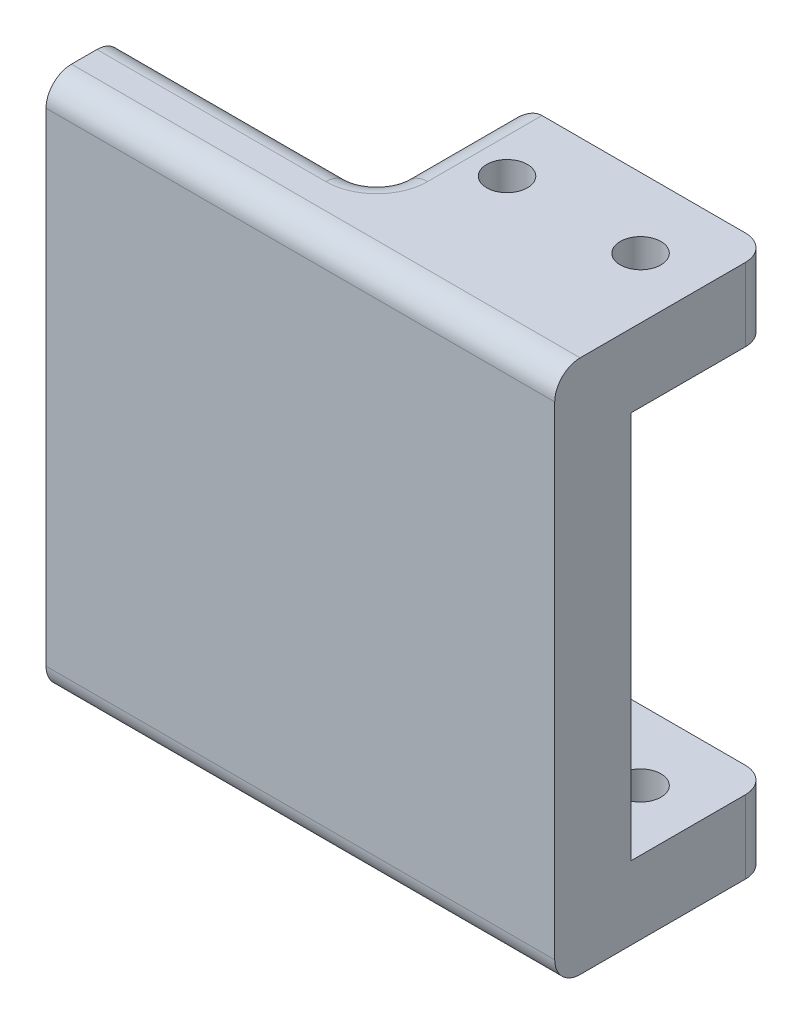
ISO-10303-21;
HEADER;
FILE_DESCRIPTION(('STEP AP214'),'2;1');
FILE_NAME('part.step','',(''),(''),'','','');
FILE_SCHEMA(('AUTOMOTIVE_DESIGN { 1 0 10303 214 1 1 1 1 }'));
ENDSEC;
DATA;
#1=APPLICATION_CONTEXT('core data for automotive mechanical design processes');
#2=APPLICATION_PROTOCOL_DEFINITION('international standard','automotive_design',2000,#1);
#3=PRODUCT_CONTEXT('',#1,'mechanical');
#4=PRODUCT('Part','Part','',(#3));
#5=PRODUCT_RELATED_PRODUCT_CATEGORY('part','',(#4));
#6=PRODUCT_DEFINITION_FORMATION('','',#4);
#7=PRODUCT_DEFINITION_CONTEXT('part definition',#1,'design');
#8=PRODUCT_DEFINITION('design','',#6,#7);
#9=PRODUCT_DEFINITION_SHAPE('','',#8);
#10=(LENGTH_UNIT() NAMED_UNIT(*) SI_UNIT(.MILLI.,.METRE.));
#11=(NAMED_UNIT(*) PLANE_ANGLE_UNIT() SI_UNIT($,.RADIAN.));
#12=(NAMED_UNIT(*) SI_UNIT($,.STERADIAN.) SOLID_ANGLE_UNIT());
#13=UNCERTAINTY_MEASURE_WITH_UNIT(LENGTH_MEASURE(1.E-05),#10,'distance_accuracy_value','');
#14=(GEOMETRIC_REPRESENTATION_CONTEXT(3) GLOBAL_UNCERTAINTY_ASSIGNED_CONTEXT((#13)) GLOBAL_UNIT_ASSIGNED_CONTEXT((#10,
#11,#12)) REPRESENTATION_CONTEXT('',''));
#15=CARTESIAN_POINT('',(0.,0.,0.));
#16=DIRECTION('',(0.,0.,1.));
#17=DIRECTION('',(1.,0.,0.));
#18=AXIS2_PLACEMENT_3D('',#15,#16,#17);
#19=CARTESIAN_POINT('',(0.,42.,-5.5));
#20=DIRECTION('',(0.,0.,-1.));
#21=DIRECTION('',(-1.,0.,0.));
#22=AXIS2_PLACEMENT_3D('',#19,#20,#21);
#23=PLANE('',#22);
#24=DIRECTION('',(1.,0.,0.));
#25=VECTOR('',#24,1.);
#26=CARTESIAN_POINT('',(-10.,36.25,-5.5));
#27=LINE('',#26,#25);
#28=CARTESIAN_POINT('',(-8.,36.25,-5.5));
#29=VERTEX_POINT('',#28);
#30=CARTESIAN_POINT('',(8.,36.25,-5.5));
#31=VERTEX_POINT('',#30);
#32=EDGE_CURVE('E204',#29,#31,#27,.T.);
#33=ORIENTED_EDGE('',*,*,#32,.F.);
#34=DIRECTION('',(0.,-1.,0.));
#35=VECTOR('',#34,1.);
#36=CARTESIAN_POINT('',(-8.,42.,-5.5));
#37=LINE('',#36,#35);
#38=CARTESIAN_POINT('',(-8.,42.,-5.5));
#39=VERTEX_POINT('',#38);
#40=EDGE_CURVE('E348',#29,#39,#37,.F.);
#41=ORIENTED_EDGE('',*,*,#40,.T.);
#42=DIRECTION('',(1.,0.,0.));
#43=VECTOR('',#42,1.);
#44=CARTESIAN_POINT('',(0.,42.,-5.5));
#45=LINE('',#44,#43);
#46=CARTESIAN_POINT('',(8.,42.,-5.5));
#47=VERTEX_POINT('',#46);
#48=EDGE_CURVE('E238',#39,#47,#45,.T.);
#49=ORIENTED_EDGE('',*,*,#48,.T.);
#50=DIRECTION('',(0.,-1.,0.));
#51=VECTOR('',#50,1.);
#52=CARTESIAN_POINT('',(8.,42.,-5.5));
#53=LINE('',#52,#51);
#54=EDGE_CURVE('E346',#47,#31,#53,.T.);
#55=ORIENTED_EDGE('',*,*,#54,.T.);
#56=EDGE_LOOP('',(#33,#41,#49,#55));
#57=FACE_BOUND('',#56,.T.);
#58=ADVANCED_FACE('F37',(#57),#23,.T.);
#59=CARTESIAN_POINT('',(-10.,42.,0.));
#60=DIRECTION('',(1.,0.,0.));
#61=DIRECTION('',(0.,0.,-1.));
#62=AXIS2_PLACEMENT_3D('',#59,#60,#61);
#63=PLANE('',#62);
#64=DIRECTION('',(0.,0.,-1.));
#65=VECTOR('',#64,1.);
#66=CARTESIAN_POINT('',(-10.,36.25,5.5));
#67=LINE('',#66,#65);
#68=CARTESIAN_POINT('',(-10.,36.25,3.50000000000001));
#69=VERTEX_POINT('',#68);
#70=CARTESIAN_POINT('',(-10.,36.25,-3.5));
#71=VERTEX_POINT('',#70);
#72=EDGE_CURVE('E214',#69,#71,#67,.T.);
#73=ORIENTED_EDGE('',*,*,#72,.F.);
#74=DIRECTION('',(0.,-1.,0.));
#75=VECTOR('',#74,1.);
#76=CARTESIAN_POINT('',(-10.,42.,3.50000000000001));
#77=LINE('',#76,#75);
#78=CARTESIAN_POINT('',(-10.,40.,3.50000000000001));
#79=VERTEX_POINT('',#78);
#80=EDGE_CURVE('E305',#69,#79,#77,.F.);
#81=ORIENTED_EDGE('',*,*,#80,.T.);
#82=DIRECTION('',(0.,0.,1.));
#83=VECTOR('',#82,1.);
#84=CARTESIAN_POINT('',(-10.,40.,-5.5));
#85=LINE('',#84,#83);
#86=CARTESIAN_POINT('',(-10.,40.,-3.5));
#87=VERTEX_POINT('',#86);
#88=EDGE_CURVE('E303',#79,#87,#85,.F.);
#89=ORIENTED_EDGE('',*,*,#88,.T.);
#90=DIRECTION('',(0.,-1.,0.));
#91=VECTOR('',#90,1.);
#92=CARTESIAN_POINT('',(-10.,36.25,-3.5));
#93=LINE('',#92,#91);
#94=EDGE_CURVE('E301',#87,#71,#93,.T.);
#95=ORIENTED_EDGE('',*,*,#94,.T.);
#96=EDGE_LOOP('',(#73,#81,#89,#95));
#97=FACE_BOUND('',#96,.T.);
#98=ADVANCED_FACE('F455',(#97),#63,.F.);
#99=CARTESIAN_POINT('',(-5.25,42.,0.));
#100=DIRECTION('',(0.,-1.,0.));
#101=DIRECTION('',(0.,0.,-1.));
#102=AXIS2_PLACEMENT_3D('',#99,#100,#101);
#103=CYLINDRICAL_SURFACE('',#102,1.6);
#104=CARTESIAN_POINT('',(-5.25,36.25,0.));
#105=DIRECTION('',(0.,1.,0.));
#106=DIRECTION('',(0.,0.,1.));
#107=AXIS2_PLACEMENT_3D('',#104,#105,#106);
#108=CIRCLE('',#107,1.6);
#109=CARTESIAN_POINT('',(-5.25,36.25,1.6));
#110=VERTEX_POINT('',#109);
#111=EDGE_CURVE('E224',#110,#110,#108,.T.);
#112=ORIENTED_EDGE('',*,*,#111,.F.);
#113=EDGE_LOOP('',(#112));
#114=FACE_BOUND('',#113,.T.);
#115=CARTESIAN_POINT('',(-5.25,42.,0.));
#116=DIRECTION('',(0.,1.,0.));
#117=DIRECTION('',(0.,0.,1.));
#118=AXIS2_PLACEMENT_3D('',#115,#116,#117);
#119=CIRCLE('',#118,1.6);
#120=CARTESIAN_POINT('',(-5.25,42.,1.6));
#121=VERTEX_POINT('',#120);
#122=EDGE_CURVE('E231',#121,#121,#119,.T.);
#123=ORIENTED_EDGE('',*,*,#122,.T.);
#124=EDGE_LOOP('',(#123));
#125=FACE_BOUND('',#124,.T.);
#126=ADVANCED_FACE('F472',(#114,#125),#103,.F.);
#127=CARTESIAN_POINT('',(5.25,42.,0.));
#128=DIRECTION('',(0.,-1.,0.));
#129=DIRECTION('',(0.,0.,-1.));
#130=AXIS2_PLACEMENT_3D('',#127,#128,#129);
#131=CYLINDRICAL_SURFACE('',#130,1.6);
#132=CARTESIAN_POINT('',(5.25,36.25,0.));
#133=DIRECTION('',(0.,1.,0.));
#134=DIRECTION('',(0.,0.,1.));
#135=AXIS2_PLACEMENT_3D('',#132,#133,#134);
#136=CIRCLE('',#135,1.6);
#137=CARTESIAN_POINT('',(5.25,36.25,1.6));
#138=VERTEX_POINT('',#137);
#139=EDGE_CURVE('E222',#138,#138,#136,.T.);
#140=ORIENTED_EDGE('',*,*,#139,.F.);
#141=EDGE_LOOP('',(#140));
#142=FACE_BOUND('',#141,.T.);
#143=CARTESIAN_POINT('',(5.25,42.,0.));
#144=DIRECTION('',(0.,1.,0.));
#145=DIRECTION('',(0.,0.,1.));
#146=AXIS2_PLACEMENT_3D('',#143,#144,#145);
#147=CIRCLE('',#146,1.6);
#148=CARTESIAN_POINT('',(5.25,42.,1.6));
#149=VERTEX_POINT('',#148);
#150=EDGE_CURVE('E228',#149,#149,#147,.T.);
#151=ORIENTED_EDGE('',*,*,#150,.T.);
#152=EDGE_LOOP('',(#151));
#153=FACE_BOUND('',#152,.T.);
#154=ADVANCED_FACE('F480',(#142,#153),#131,.F.);
#155=CARTESIAN_POINT('',(10.,42.,0.));
#156=DIRECTION('',(1.,0.,0.));
#157=DIRECTION('',(0.,0.,-1.));
#158=AXIS2_PLACEMENT_3D('',#155,#156,#157);
#159=PLANE('',#158);
#160=DIRECTION('',(0.,-1.,0.));
#161=VECTOR('',#160,1.);
#162=CARTESIAN_POINT('',(10.,42.,11.5));
#163=LINE('',#162,#161);
#164=CARTESIAN_POINT('',(10.,40.,11.5));
#165=VERTEX_POINT('',#164);
#166=CARTESIAN_POINT('',(10.,2.00000000000002,11.5));
#167=VERTEX_POINT('',#166);
#168=EDGE_CURVE('E244',#165,#167,#163,.T.);
#169=ORIENTED_EDGE('',*,*,#168,.T.);
#170=CARTESIAN_POINT('',(10.,2.,9.50000000000001));
#171=DIRECTION('',(1.,0.,0.));
#172=DIRECTION('',(0.,0.,-1.));
#173=AXIS2_PLACEMENT_3D('',#170,#171,#172);
#174=CIRCLE('',#173,2.);
#175=CARTESIAN_POINT('',(10.,0.,9.50000000000001));
#176=VERTEX_POINT('',#175);
#177=EDGE_CURVE('E325',#167,#176,#174,.T.);
#178=ORIENTED_EDGE('',*,*,#177,.T.);
#179=DIRECTION('',(0.,0.,1.));
#180=VECTOR('',#179,1.);
#181=CARTESIAN_POINT('',(10.,0.,0.));
#182=LINE('',#181,#180);
#183=CARTESIAN_POINT('',(10.,0.,-3.5));
#184=VERTEX_POINT('',#183);
#185=EDGE_CURVE('E250',#184,#176,#182,.T.);
#186=ORIENTED_EDGE('',*,*,#185,.F.);
#187=DIRECTION('',(0.,-1.,0.));
#188=VECTOR('',#187,1.);
#189=CARTESIAN_POINT('',(10.,42.,-3.5));
#190=LINE('',#189,#188);
#191=CARTESIAN_POINT('',(10.,5.75,-3.5));
#192=VERTEX_POINT('',#191);
#193=EDGE_CURVE('E210',#184,#192,#190,.F.);
#194=ORIENTED_EDGE('',*,*,#193,.T.);
#195=DIRECTION('',(0.,0.,-1.));
#196=VECTOR('',#195,1.);
#197=CARTESIAN_POINT('',(10.,5.75,5.5));
#198=LINE('',#197,#196);
#199=CARTESIAN_POINT('',(10.,5.75,5.5));
#200=VERTEX_POINT('',#199);
#201=EDGE_CURVE('E188',#200,#192,#198,.T.);
#202=ORIENTED_EDGE('',*,*,#201,.F.);
#203=DIRECTION('',(0.,-1.,0.));
#204=VECTOR('',#203,1.);
#205=CARTESIAN_POINT('',(10.,36.25,5.5));
#206=LINE('',#205,#204);
#207=CARTESIAN_POINT('',(10.,36.25,5.5));
#208=VERTEX_POINT('',#207);
#209=EDGE_CURVE('E195',#208,#200,#206,.T.);
#210=ORIENTED_EDGE('',*,*,#209,.F.);
#211=DIRECTION('',(0.,0.,-1.));
#212=VECTOR('',#211,1.);
#213=CARTESIAN_POINT('',(10.,36.25,5.5));
#214=LINE('',#213,#212);
#215=CARTESIAN_POINT('',(10.,36.25,-3.5));
#216=VERTEX_POINT('',#215);
#217=EDGE_CURVE('E268',#208,#216,#214,.T.);
#218=ORIENTED_EDGE('',*,*,#217,.T.);
#219=DIRECTION('',(0.,-1.,0.));
#220=VECTOR('',#219,1.);
#221=CARTESIAN_POINT('',(10.,42.,-3.5));
#222=LINE('',#221,#220);
#223=CARTESIAN_POINT('',(10.,42.,-3.5));
#224=VERTEX_POINT('',#223);
#225=EDGE_CURVE('E320',#216,#224,#222,.F.);
#226=ORIENTED_EDGE('',*,*,#225,.T.);
#227=DIRECTION('',(0.,0.,1.));
#228=VECTOR('',#227,1.);
#229=CARTESIAN_POINT('',(10.,42.,0.));
#230=LINE('',#229,#228);
#231=CARTESIAN_POINT('',(10.,42.,9.50000000000001));
#232=VERTEX_POINT('',#231);
#233=EDGE_CURVE('E235',#224,#232,#230,.T.);
#234=ORIENTED_EDGE('',*,*,#233,.T.);
#235=CARTESIAN_POINT('',(10.,40.,9.50000000000001));
#236=DIRECTION('',(1.,0.,0.));
#237=DIRECTION('',(0.,0.,-1.));
#238=AXIS2_PLACEMENT_3D('',#235,#236,#237);
#239=CIRCLE('',#238,2.);
#240=EDGE_CURVE('E323',#232,#165,#239,.T.);
#241=ORIENTED_EDGE('',*,*,#240,.T.);
#242=EDGE_LOOP('',(#169,#178,#186,#194,#202,#210,#218,#226,#234,#241));
#243=FACE_BOUND('',#242,.T.);
#244=ADVANCED_FACE('F207',(#243),#159,.T.);
#245=DIRECTION('',(-1.,0.,0.));
#246=VECTOR('',#245,1.);
#247=CARTESIAN_POINT('',(-10.,5.75,-5.5));
#248=LINE('',#247,#246);
#249=CARTESIAN_POINT('',(7.99999999999999,5.75,-5.5));
#250=VERTEX_POINT('',#249);
#251=CARTESIAN_POINT('',(-8.,5.75,-5.5));
#252=VERTEX_POINT('',#251);
#253=EDGE_CURVE('E362',#250,#252,#248,.T.);
#254=ORIENTED_EDGE('',*,*,#253,.F.);
#255=DIRECTION('',(0.,-1.,0.));
#256=VECTOR('',#255,1.);
#257=CARTESIAN_POINT('',(8.,42.,-5.5));
#258=LINE('',#257,#256);
#259=CARTESIAN_POINT('',(8.,0.,-5.5));
#260=VERTEX_POINT('',#259);
#261=EDGE_CURVE('E337',#250,#260,#258,.T.);
#262=ORIENTED_EDGE('',*,*,#261,.T.);
#263=DIRECTION('',(1.,0.,0.));
#264=VECTOR('',#263,1.);
#265=CARTESIAN_POINT('',(0.,0.,-5.5));
#266=LINE('',#265,#264);
#267=CARTESIAN_POINT('',(-8.,0.,-5.5));
#268=VERTEX_POINT('',#267);
#269=EDGE_CURVE('E253',#268,#260,#266,.T.);
#270=ORIENTED_EDGE('',*,*,#269,.F.);
#271=DIRECTION('',(0.,-1.,0.));
#272=VECTOR('',#271,1.);
#273=CARTESIAN_POINT('',(-8.,5.75,-5.5));
#274=LINE('',#273,#272);
#275=EDGE_CURVE('E335',#268,#252,#274,.F.);
#276=ORIENTED_EDGE('',*,*,#275,.T.);
#277=EDGE_LOOP('',(#254,#262,#270,#276));
#278=FACE_BOUND('',#277,.T.);
#279=ADVANCED_FACE('F431',(#278),#23,.T.);
#280=DIRECTION('',(0.,0.,1.));
#281=VECTOR('',#280,1.);
#282=CARTESIAN_POINT('',(-10.,2.,0.));
#283=LINE('',#282,#281);
#284=CARTESIAN_POINT('',(-10.,2.,-3.5));
#285=VERTEX_POINT('',#284);
#286=CARTESIAN_POINT('',(-10.,2.,3.50000000000001));
#287=VERTEX_POINT('',#286);
#288=EDGE_CURVE('E272',#285,#287,#283,.T.);
#289=ORIENTED_EDGE('',*,*,#288,.T.);
#290=DIRECTION('',(0.,-1.,0.));
#291=VECTOR('',#290,1.);
#292=CARTESIAN_POINT('',(-10.,5.75000000000002,3.50000000000001));
#293=LINE('',#292,#291);
#294=CARTESIAN_POINT('',(-10.,5.75,3.50000000000001));
#295=VERTEX_POINT('',#294);
#296=EDGE_CURVE('E275',#287,#295,#293,.F.);
#297=ORIENTED_EDGE('',*,*,#296,.T.);
#298=DIRECTION('',(0.,0.,-1.));
#299=VECTOR('',#298,1.);
#300=CARTESIAN_POINT('',(-10.,5.75,5.5));
#301=LINE('',#300,#299);
#302=CARTESIAN_POINT('',(-10.,5.75,-3.5));
#303=VERTEX_POINT('',#302);
#304=EDGE_CURVE('E211',#295,#303,#301,.T.);
#305=ORIENTED_EDGE('',*,*,#304,.T.);
#306=DIRECTION('',(0.,-1.,0.));
#307=VECTOR('',#306,1.);
#308=CARTESIAN_POINT('',(-10.,0.,-3.5));
#309=LINE('',#308,#307);
#310=EDGE_CURVE('E265',#303,#285,#309,.T.);
#311=ORIENTED_EDGE('',*,*,#310,.T.);
#312=EDGE_LOOP('',(#289,#297,#305,#311));
#313=FACE_BOUND('',#312,.T.);
#314=ADVANCED_FACE('F422',(#313),#63,.F.);
#315=CARTESIAN_POINT('',(0.,42.,5.5));
#316=DIRECTION('',(0.,0.,1.));
#317=DIRECTION('',(1.,0.,0.));
#318=AXIS2_PLACEMENT_3D('',#315,#316,#317);
#319=PLANE('',#318);
#320=DIRECTION('',(0.,-1.,0.));
#321=VECTOR('',#320,1.);
#322=CARTESIAN_POINT('',(-30.,42.,5.50000000000001));
#323=LINE('',#322,#321);
#324=CARTESIAN_POINT('',(-30.,40.,5.50000000000001));
#325=VERTEX_POINT('',#324);
#326=CARTESIAN_POINT('',(-30.,2.00000000000002,5.50000000000001));
#327=VERTEX_POINT('',#326);
#328=EDGE_CURVE('E262',#325,#327,#323,.T.);
#329=ORIENTED_EDGE('',*,*,#328,.F.);
#330=DIRECTION('',(-1.,0.,0.));
#331=VECTOR('',#330,1.);
#332=CARTESIAN_POINT('',(-10.,40.,5.50000000000001));
#333=LINE('',#332,#331);
#334=CARTESIAN_POINT('',(-12.,40.,5.50000000000001));
#335=VERTEX_POINT('',#334);
#336=EDGE_CURVE('E333',#325,#335,#333,.F.);
#337=ORIENTED_EDGE('',*,*,#336,.T.);
#338=DIRECTION('',(0.,-1.,0.));
#339=VECTOR('',#338,1.);
#340=CARTESIAN_POINT('',(-12.,36.25,5.50000000000001));
#341=LINE('',#340,#339);
#342=CARTESIAN_POINT('',(-12.,36.25,5.5));
#343=VERTEX_POINT('',#342);
#344=EDGE_CURVE('E331',#335,#343,#341,.T.);
#345=ORIENTED_EDGE('',*,*,#344,.T.);
#346=DIRECTION('',(1.,0.,0.));
#347=VECTOR('',#346,1.);
#348=CARTESIAN_POINT('',(-10.,36.25,5.5));
#349=LINE('',#348,#347);
#350=EDGE_CURVE('E194',#343,#208,#349,.T.);
#351=ORIENTED_EDGE('',*,*,#350,.T.);
#352=ORIENTED_EDGE('',*,*,#209,.T.);
#353=DIRECTION('',(-1.,0.,0.));
#354=VECTOR('',#353,1.);
#355=CARTESIAN_POINT('',(-10.,5.75,5.5));
#356=LINE('',#355,#354);
#357=CARTESIAN_POINT('',(-12.,5.75,5.5));
#358=VERTEX_POINT('',#357);
#359=EDGE_CURVE('E184',#200,#358,#356,.T.);
#360=ORIENTED_EDGE('',*,*,#359,.T.);
#361=DIRECTION('',(0.,-1.,0.));
#362=VECTOR('',#361,1.);
#363=CARTESIAN_POINT('',(-12.,0.,5.50000000000001));
#364=LINE('',#363,#362);
#365=CARTESIAN_POINT('',(-12.,2.,5.50000000000001));
#366=VERTEX_POINT('',#365);
#367=EDGE_CURVE('E327',#358,#366,#364,.T.);
#368=ORIENTED_EDGE('',*,*,#367,.T.);
#369=DIRECTION('',(-1.,0.,0.));
#370=VECTOR('',#369,1.);
#371=CARTESIAN_POINT('',(0.,2.,5.5));
#372=LINE('',#371,#370);
#373=EDGE_CURVE('E329',#366,#327,#372,.T.);
#374=ORIENTED_EDGE('',*,*,#373,.T.);
#375=EDGE_LOOP('',(#329,#337,#345,#351,#352,#360,#368,#374));
#376=FACE_BOUND('',#375,.T.);
#377=ADVANCED_FACE('F200',(#376),#319,.F.);
#378=CARTESIAN_POINT('',(-30.,42.,0.));
#379=DIRECTION('',(1.,0.,0.));
#380=DIRECTION('',(0.,0.,-1.));
#381=AXIS2_PLACEMENT_3D('',#378,#379,#380);
#382=PLANE('',#381);
#383=DIRECTION('',(0.,0.,1.));
#384=VECTOR('',#383,1.);
#385=CARTESIAN_POINT('',(-30.,0.,0.));
#386=LINE('',#385,#384);
#387=CARTESIAN_POINT('',(-30.,0.,7.50000000000001));
#388=VERTEX_POINT('',#387);
#389=CARTESIAN_POINT('',(-30.,0.,9.50000000000001));
#390=VERTEX_POINT('',#389);
#391=EDGE_CURVE('E232',#388,#390,#386,.T.);
#392=ORIENTED_EDGE('',*,*,#391,.T.);
#393=CARTESIAN_POINT('',(-30.,2.,9.50000000000001));
#394=DIRECTION('',(1.,0.,0.));
#395=DIRECTION('',(0.,0.,-1.));
#396=AXIS2_PLACEMENT_3D('',#393,#394,#395);
#397=CIRCLE('',#396,2.);
#398=CARTESIAN_POINT('',(-30.,2.00000000000002,11.5));
#399=VERTEX_POINT('',#398);
#400=EDGE_CURVE('E313',#390,#399,#397,.F.);
#401=ORIENTED_EDGE('',*,*,#400,.T.);
#402=DIRECTION('',(0.,-1.,0.));
#403=VECTOR('',#402,1.);
#404=CARTESIAN_POINT('',(-30.,42.,11.5));
#405=LINE('',#404,#403);
#406=CARTESIAN_POINT('',(-30.,40.,11.5));
#407=VERTEX_POINT('',#406);
#408=EDGE_CURVE('E259',#407,#399,#405,.T.);
#409=ORIENTED_EDGE('',*,*,#408,.F.);
#410=CARTESIAN_POINT('',(-30.,40.,9.50000000000001));
#411=DIRECTION('',(1.,0.,0.));
#412=DIRECTION('',(0.,0.,-1.));
#413=AXIS2_PLACEMENT_3D('',#410,#411,#412);
#414=CIRCLE('',#413,2.);
#415=CARTESIAN_POINT('',(-30.,42.,9.50000000000001));
#416=VERTEX_POINT('',#415);
#417=EDGE_CURVE('E311',#407,#416,#414,.F.);
#418=ORIENTED_EDGE('',*,*,#417,.T.);
#419=DIRECTION('',(0.,0.,1.));
#420=VECTOR('',#419,1.);
#421=CARTESIAN_POINT('',(-30.,42.,0.));
#422=LINE('',#421,#420);
#423=CARTESIAN_POINT('',(-30.,42.,7.50000000000001));
#424=VERTEX_POINT('',#423);
#425=EDGE_CURVE('E241',#424,#416,#422,.T.);
#426=ORIENTED_EDGE('',*,*,#425,.F.);
#427=CARTESIAN_POINT('',(-30.,40.,7.50000000000001));
#428=DIRECTION('',(1.,0.,0.));
#429=DIRECTION('',(0.,0.,-1.));
#430=AXIS2_PLACEMENT_3D('',#427,#428,#429);
#431=CIRCLE('',#430,2.);
#432=EDGE_CURVE('E307',#424,#325,#431,.F.);
#433=ORIENTED_EDGE('',*,*,#432,.T.);
#434=ORIENTED_EDGE('',*,*,#328,.T.);
#435=CARTESIAN_POINT('',(-30.,2.,7.50000000000001));
#436=DIRECTION('',(1.,0.,0.));
#437=DIRECTION('',(0.,0.,-1.));
#438=AXIS2_PLACEMENT_3D('',#435,#436,#437);
#439=CIRCLE('',#438,2.);
#440=EDGE_CURVE('E309',#327,#388,#439,.F.);
#441=ORIENTED_EDGE('',*,*,#440,.T.);
#442=EDGE_LOOP('',(#392,#401,#409,#418,#426,#433,#434,#441));
#443=FACE_BOUND('',#442,.T.);
#444=ADVANCED_FACE('F385',(#443),#382,.F.);
#445=CARTESIAN_POINT('',(-5.25,5.75,0.));
#446=DIRECTION('',(0.,-1.,0.));
#447=DIRECTION('',(0.,0.,-1.));
#448=AXIS2_PLACEMENT_3D('',#445,#446,#447);
#449=CIRCLE('',#448,1.6);
#450=CARTESIAN_POINT('',(-5.25,5.75,-1.6));
#451=VERTEX_POINT('',#450);
#452=EDGE_CURVE('E219',#451,#451,#449,.T.);
#453=ORIENTED_EDGE('',*,*,#452,.F.);
#454=EDGE_LOOP('',(#453));
#455=FACE_BOUND('',#454,.T.);
#456=CARTESIAN_POINT('',(-5.25,0.,0.));
#457=DIRECTION('',(0.,1.,0.));
#458=DIRECTION('',(0.,0.,1.));
#459=AXIS2_PLACEMENT_3D('',#456,#457,#458);
#460=CIRCLE('',#459,1.6);
#461=CARTESIAN_POINT('',(-5.25,0.,1.6));
#462=VERTEX_POINT('',#461);
#463=EDGE_CURVE('E247',#462,#462,#460,.T.);
#464=ORIENTED_EDGE('',*,*,#463,.F.);
#465=EDGE_LOOP('',(#464));
#466=FACE_BOUND('',#465,.T.);
#467=ADVANCED_FACE('F488',(#455,#466),#103,.F.);
#468=CARTESIAN_POINT('',(5.25,5.75,0.));
#469=DIRECTION('',(0.,-1.,0.));
#470=DIRECTION('',(0.,0.,-1.));
#471=AXIS2_PLACEMENT_3D('',#468,#469,#470);
#472=CIRCLE('',#471,1.6);
#473=CARTESIAN_POINT('',(5.25,5.75,-1.6));
#474=VERTEX_POINT('',#473);
#475=EDGE_CURVE('E223',#474,#474,#472,.T.);
#476=ORIENTED_EDGE('',*,*,#475,.F.);
#477=EDGE_LOOP('',(#476));
#478=FACE_BOUND('',#477,.T.);
#479=CARTESIAN_POINT('',(5.25,0.,0.));
#480=DIRECTION('',(0.,1.,0.));
#481=DIRECTION('',(0.,0.,1.));
#482=AXIS2_PLACEMENT_3D('',#479,#480,#481);
#483=CIRCLE('',#482,1.6);
#484=CARTESIAN_POINT('',(5.25,0.,1.6));
#485=VERTEX_POINT('',#484);
#486=EDGE_CURVE('E227',#485,#485,#483,.T.);
#487=ORIENTED_EDGE('',*,*,#486,.F.);
#488=EDGE_LOOP('',(#487));
#489=FACE_BOUND('',#488,.T.);
#490=ADVANCED_FACE('F486',(#478,#489),#131,.F.);
#491=CARTESIAN_POINT('',(0.,42.,11.5));
#492=DIRECTION('',(0.,0.,1.));
#493=DIRECTION('',(1.,0.,0.));
#494=AXIS2_PLACEMENT_3D('',#491,#492,#493);
#495=PLANE('',#494);
#496=ORIENTED_EDGE('',*,*,#408,.T.);
#497=DIRECTION('',(-1.,0.,0.));
#498=VECTOR('',#497,1.);
#499=CARTESIAN_POINT('',(10.,2.,11.5));
#500=LINE('',#499,#498);
#501=EDGE_CURVE('E318',#399,#167,#500,.F.);
#502=ORIENTED_EDGE('',*,*,#501,.T.);
#503=ORIENTED_EDGE('',*,*,#168,.F.);
#504=DIRECTION('',(-1.,0.,0.));
#505=VECTOR('',#504,1.);
#506=CARTESIAN_POINT('',(0.,40.,11.5));
#507=LINE('',#506,#505);
#508=EDGE_CURVE('E315',#165,#407,#507,.T.);
#509=ORIENTED_EDGE('',*,*,#508,.T.);
#510=EDGE_LOOP('',(#496,#502,#503,#509));
#511=FACE_BOUND('',#510,.T.);
#512=ADVANCED_FACE('F393',(#511),#495,.T.);
#513=CARTESIAN_POINT('',(0.,42.,0.));
#514=DIRECTION('',(0.,1.,0.));
#515=DIRECTION('',(0.,0.,1.));
#516=AXIS2_PLACEMENT_3D('',#513,#514,#515);
#517=PLANE('',#516);
#518=ORIENTED_EDGE('',*,*,#150,.F.);
#519=EDGE_LOOP('',(#518));
#520=FACE_BOUND('',#519,.T.);
#521=ORIENTED_EDGE('',*,*,#122,.F.);
#522=EDGE_LOOP('',(#521));
#523=FACE_BOUND('',#522,.T.);
#524=ORIENTED_EDGE('',*,*,#425,.T.);
#525=DIRECTION('',(-1.,0.,0.));
#526=VECTOR('',#525,1.);
#527=CARTESIAN_POINT('',(0.,42.,9.50000000000001));
#528=LINE('',#527,#526);
#529=EDGE_CURVE('E299',#416,#232,#528,.F.);
#530=ORIENTED_EDGE('',*,*,#529,.T.);
#531=ORIENTED_EDGE('',*,*,#233,.F.);
#532=CARTESIAN_POINT('',(8.,42.,-3.5));
#533=DIRECTION('',(0.,1.,0.));
#534=DIRECTION('',(0.,0.,1.));
#535=AXIS2_PLACEMENT_3D('',#532,#533,#534);
#536=CIRCLE('',#535,2.);
#537=EDGE_CURVE('E289',#224,#47,#536,.T.);
#538=ORIENTED_EDGE('',*,*,#537,.T.);
#539=ORIENTED_EDGE('',*,*,#48,.F.);
#540=DIRECTION('',(0.,0.,1.));
#541=VECTOR('',#540,1.);
#542=CARTESIAN_POINT('',(-8.,42.,5.5));
#543=LINE('',#542,#541);
#544=CARTESIAN_POINT('',(-8.,42.,3.50000000000001));
#545=VERTEX_POINT('',#544);
#546=EDGE_CURVE('E296',#39,#545,#543,.T.);
#547=ORIENTED_EDGE('',*,*,#546,.T.);
#548=CARTESIAN_POINT('',(-12.,42.,3.50000000000001));
#549=DIRECTION('',(0.,1.,0.));
#550=DIRECTION('',(0.,0.,1.));
#551=AXIS2_PLACEMENT_3D('',#548,#549,#550);
#552=CIRCLE('',#551,4.);
#553=CARTESIAN_POINT('',(-12.,42.,7.50000000000001));
#554=VERTEX_POINT('',#553);
#555=EDGE_CURVE('E293',#554,#545,#552,.T.);
#556=ORIENTED_EDGE('',*,*,#555,.F.);
#557=DIRECTION('',(-1.,0.,0.));
#558=VECTOR('',#557,1.);
#559=CARTESIAN_POINT('',(-30.,42.,7.50000000000001));
#560=LINE('',#559,#558);
#561=EDGE_CURVE('E291',#554,#424,#560,.T.);
#562=ORIENTED_EDGE('',*,*,#561,.T.);
#563=EDGE_LOOP('',(#524,#530,#531,#538,#539,#547,#556,#562));
#564=FACE_BOUND('',#563,.T.);
#565=ADVANCED_FACE('F382',(#520,#523,#564),#517,.T.);
#566=CARTESIAN_POINT('',(0.,0.,0.));
#567=DIRECTION('',(0.,1.,0.));
#568=DIRECTION('',(0.,0.,1.));
#569=AXIS2_PLACEMENT_3D('',#566,#567,#568);
#570=PLANE('',#569);
#571=ORIENTED_EDGE('',*,*,#486,.T.);
#572=EDGE_LOOP('',(#571));
#573=FACE_BOUND('',#572,.T.);
#574=ORIENTED_EDGE('',*,*,#463,.T.);
#575=EDGE_LOOP('',(#574));
#576=FACE_BOUND('',#575,.T.);
#577=ORIENTED_EDGE('',*,*,#185,.T.);
#578=DIRECTION('',(-1.,0.,0.));
#579=VECTOR('',#578,1.);
#580=CARTESIAN_POINT('',(-30.,0.,9.50000000000001));
#581=LINE('',#580,#579);
#582=EDGE_CURVE('E286',#176,#390,#581,.T.);
#583=ORIENTED_EDGE('',*,*,#582,.T.);
#584=ORIENTED_EDGE('',*,*,#391,.F.);
#585=DIRECTION('',(-1.,0.,0.));
#586=VECTOR('',#585,1.);
#587=CARTESIAN_POINT('',(0.,0.,7.5));
#588=LINE('',#587,#586);
#589=CARTESIAN_POINT('',(-12.,0.,7.50000000000001));
#590=VERTEX_POINT('',#589);
#591=EDGE_CURVE('E282',#388,#590,#588,.F.);
#592=ORIENTED_EDGE('',*,*,#591,.T.);
#593=CARTESIAN_POINT('',(-12.,0.,3.50000000000001));
#594=DIRECTION('',(0.,1.,0.));
#595=DIRECTION('',(0.,0.,1.));
#596=AXIS2_PLACEMENT_3D('',#593,#594,#595);
#597=CIRCLE('',#596,4.);
#598=CARTESIAN_POINT('',(-8.,0.,3.50000000000001));
#599=VERTEX_POINT('',#598);
#600=EDGE_CURVE('E279',#599,#590,#597,.F.);
#601=ORIENTED_EDGE('',*,*,#600,.F.);
#602=DIRECTION('',(0.,0.,1.));
#603=VECTOR('',#602,1.);
#604=CARTESIAN_POINT('',(-8.,0.,0.));
#605=LINE('',#604,#603);
#606=EDGE_CURVE('E284',#599,#268,#605,.F.);
#607=ORIENTED_EDGE('',*,*,#606,.T.);
#608=ORIENTED_EDGE('',*,*,#269,.T.);
#609=CARTESIAN_POINT('',(8.,0.,-3.5));
#610=DIRECTION('',(0.,1.,0.));
#611=DIRECTION('',(0.,0.,1.));
#612=AXIS2_PLACEMENT_3D('',#609,#610,#611);
#613=CIRCLE('',#612,2.);
#614=EDGE_CURVE('E277',#260,#184,#613,.F.);
#615=ORIENTED_EDGE('',*,*,#614,.T.);
#616=EDGE_LOOP('',(#577,#583,#584,#592,#601,#607,#608,#615));
#617=FACE_BOUND('',#616,.T.);
#618=ADVANCED_FACE('F401',(#573,#576,#617),#570,.F.);
#619=CARTESIAN_POINT('',(-10.,36.25,5.5));
#620=DIRECTION('',(0.,1.,0.));
#621=DIRECTION('',(0.,0.,1.));
#622=AXIS2_PLACEMENT_3D('',#619,#620,#621);
#623=PLANE('',#622);
#624=ORIENTED_EDGE('',*,*,#111,.T.);
#625=EDGE_LOOP('',(#624));
#626=FACE_BOUND('',#625,.T.);
#627=ORIENTED_EDGE('',*,*,#139,.T.);
#628=EDGE_LOOP('',(#627));
#629=FACE_BOUND('',#628,.T.);
#630=ORIENTED_EDGE('',*,*,#72,.T.);
#631=CARTESIAN_POINT('',(-8.,36.25,-3.5));
#632=DIRECTION('',(0.,1.,0.));
#633=DIRECTION('',(0.,0.,1.));
#634=AXIS2_PLACEMENT_3D('',#631,#632,#633);
#635=CIRCLE('',#634,2.);
#636=EDGE_CURVE('E62',#71,#29,#635,.F.);
#637=ORIENTED_EDGE('',*,*,#636,.T.);
#638=ORIENTED_EDGE('',*,*,#32,.T.);
#639=CARTESIAN_POINT('',(8.,36.25,-3.5));
#640=DIRECTION('',(0.,1.,0.));
#641=DIRECTION('',(0.,0.,1.));
#642=AXIS2_PLACEMENT_3D('',#639,#640,#641);
#643=CIRCLE('',#642,2.);
#644=EDGE_CURVE('E54',#31,#216,#643,.F.);
#645=ORIENTED_EDGE('',*,*,#644,.T.);
#646=ORIENTED_EDGE('',*,*,#217,.F.);
#647=ORIENTED_EDGE('',*,*,#350,.F.);
#648=CARTESIAN_POINT('',(-12.,36.25,3.50000000000001));
#649=DIRECTION('',(0.,1.,0.));
#650=DIRECTION('',(0.,0.,1.));
#651=AXIS2_PLACEMENT_3D('',#648,#649,#650);
#652=CIRCLE('',#651,2.);
#653=EDGE_CURVE('E46',#343,#69,#652,.T.);
#654=ORIENTED_EDGE('',*,*,#653,.T.);
#655=EDGE_LOOP('',(#630,#637,#638,#645,#646,#647,#654));
#656=FACE_BOUND('',#655,.T.);
#657=ADVANCED_FACE('F437',(#626,#629,#656),#623,.F.);
#658=CARTESIAN_POINT('',(-10.,5.75,5.5));
#659=DIRECTION('',(0.,-1.,0.));
#660=DIRECTION('',(0.,0.,-1.));
#661=AXIS2_PLACEMENT_3D('',#658,#659,#660);
#662=PLANE('',#661);
#663=ORIENTED_EDGE('',*,*,#452,.T.);
#664=EDGE_LOOP('',(#663));
#665=FACE_BOUND('',#664,.T.);
#666=ORIENTED_EDGE('',*,*,#475,.T.);
#667=EDGE_LOOP('',(#666));
#668=FACE_BOUND('',#667,.T.);
#669=ORIENTED_EDGE('',*,*,#201,.T.);
#670=CARTESIAN_POINT('',(8.,5.75,-3.5));
#671=DIRECTION('',(0.,-1.,0.));
#672=DIRECTION('',(0.,0.,-1.));
#673=AXIS2_PLACEMENT_3D('',#670,#671,#672);
#674=CIRCLE('',#673,2.);
#675=EDGE_CURVE('E342',#192,#250,#674,.F.);
#676=ORIENTED_EDGE('',*,*,#675,.T.);
#677=ORIENTED_EDGE('',*,*,#253,.T.);
#678=CARTESIAN_POINT('',(-8.,5.75,-3.5));
#679=DIRECTION('',(0.,-1.,0.));
#680=DIRECTION('',(0.,0.,-1.));
#681=AXIS2_PLACEMENT_3D('',#678,#679,#680);
#682=CIRCLE('',#681,2.);
#683=EDGE_CURVE('E340',#252,#303,#682,.F.);
#684=ORIENTED_EDGE('',*,*,#683,.T.);
#685=ORIENTED_EDGE('',*,*,#304,.F.);
#686=CARTESIAN_POINT('',(-12.,5.75,3.50000000000001));
#687=DIRECTION('',(0.,-1.,0.));
#688=DIRECTION('',(0.,0.,-1.));
#689=AXIS2_PLACEMENT_3D('',#686,#687,#688);
#690=CIRCLE('',#689,2.);
#691=EDGE_CURVE('E11',#295,#358,#690,.T.);
#692=ORIENTED_EDGE('',*,*,#691,.T.);
#693=ORIENTED_EDGE('',*,*,#359,.F.);
#694=EDGE_LOOP('',(#669,#676,#677,#684,#685,#692,#693));
#695=FACE_BOUND('',#694,.T.);
#696=ADVANCED_FACE('F186',(#665,#668,#695),#662,.F.);
#697=CARTESIAN_POINT('',(-12.,42.,3.50000000000001));
#698=DIRECTION('',(0.,1.,0.));
#699=DIRECTION('',(0.,0.,1.));
#700=AXIS2_PLACEMENT_3D('',#697,#698,#699);
#701=CYLINDRICAL_SURFACE('',#700,2.);
#702=ORIENTED_EDGE('',*,*,#691,.F.);
#703=ORIENTED_EDGE('',*,*,#296,.F.);
#704=CARTESIAN_POINT('',(-12.,2.,3.50000000000001));
#705=DIRECTION('',(0.,1.,0.));
#706=DIRECTION('',(0.,0.,1.));
#707=AXIS2_PLACEMENT_3D('',#704,#705,#706);
#708=CIRCLE('',#707,2.);
#709=EDGE_CURVE('E359',#366,#287,#708,.T.);
#710=ORIENTED_EDGE('',*,*,#709,.F.);
#711=ORIENTED_EDGE('',*,*,#367,.F.);
#712=EDGE_LOOP('',(#702,#703,#710,#711));
#713=FACE_BOUND('',#712,.T.);
#714=ADVANCED_FACE('F420',(#713),#701,.F.);
#715=CARTESIAN_POINT('',(0.,2.,7.5));
#716=DIRECTION('',(-1.,0.,0.));
#717=DIRECTION('',(0.,0.,1.));
#718=AXIS2_PLACEMENT_3D('',#715,#716,#717);
#719=CYLINDRICAL_SURFACE('',#718,2.);
#720=ORIENTED_EDGE('',*,*,#440,.F.);
#721=ORIENTED_EDGE('',*,*,#373,.F.);
#722=CARTESIAN_POINT('',(-12.,2.,7.50000000000001));
#723=DIRECTION('',(1.,0.,0.));
#724=DIRECTION('',(0.,0.,-1.));
#725=AXIS2_PLACEMENT_3D('',#722,#723,#724);
#726=CIRCLE('',#725,2.);
#727=EDGE_CURVE('E356',#590,#366,#726,.T.);
#728=ORIENTED_EDGE('',*,*,#727,.F.);
#729=ORIENTED_EDGE('',*,*,#591,.F.);
#730=EDGE_LOOP('',(#720,#721,#728,#729));
#731=FACE_BOUND('',#730,.T.);
#732=ADVANCED_FACE('F406',(#731),#719,.T.);
#733=CARTESIAN_POINT('',(-8.,42.,-3.5));
#734=DIRECTION('',(0.,1.,0.));
#735=DIRECTION('',(0.,0.,1.));
#736=AXIS2_PLACEMENT_3D('',#733,#734,#735);
#737=CYLINDRICAL_SURFACE('',#736,2.);
#738=ORIENTED_EDGE('',*,*,#683,.F.);
#739=ORIENTED_EDGE('',*,*,#275,.F.);
#740=CARTESIAN_POINT('',(-8.,2.,-3.5));
#741=DIRECTION('',(0.,0.707106781186547,-0.707106781186547));
#742=DIRECTION('',(0.,0.707106781186547,0.707106781186547));
#743=AXIS2_PLACEMENT_3D('',#740,#741,#742);
#744=ELLIPSE('',#743,2.82842712474619,2.);
#745=EDGE_CURVE('E353',#285,#268,#744,.F.);
#746=ORIENTED_EDGE('',*,*,#745,.F.);
#747=ORIENTED_EDGE('',*,*,#310,.F.);
#748=EDGE_LOOP('',(#738,#739,#746,#747));
#749=FACE_BOUND('',#748,.T.);
#750=ADVANCED_FACE('F427',(#749),#737,.T.);
#751=CARTESIAN_POINT('',(-12.,2.,3.50000000000001));
#752=DIRECTION('',(0.,1.,0.));
#753=DIRECTION('',(0.,0.,1.));
#754=AXIS2_PLACEMENT_3D('',#751,#752,#753);
#755=TOROIDAL_SURFACE('',#754,4.,2.);
#756=ORIENTED_EDGE('',*,*,#727,.T.);
#757=ORIENTED_EDGE('',*,*,#709,.T.);
#758=CARTESIAN_POINT('',(-8.,2.,3.50000000000001));
#759=DIRECTION('',(0.,0.,1.));
#760=DIRECTION('',(1.,0.,0.));
#761=AXIS2_PLACEMENT_3D('',#758,#759,#760);
#762=CIRCLE('',#761,2.);
#763=EDGE_CURVE('E351',#599,#287,#762,.F.);
#764=ORIENTED_EDGE('',*,*,#763,.F.);
#765=ORIENTED_EDGE('',*,*,#600,.T.);
#766=EDGE_LOOP('',(#756,#757,#764,#765));
#767=FACE_BOUND('',#766,.T.);
#768=ADVANCED_FACE('F417',(#767),#755,.T.);
#769=CARTESIAN_POINT('',(-8.,2.,0.));
#770=DIRECTION('',(0.,0.,1.));
#771=DIRECTION('',(1.,0.,0.));
#772=AXIS2_PLACEMENT_3D('',#769,#770,#771);
#773=CYLINDRICAL_SURFACE('',#772,2.);
#774=ORIENTED_EDGE('',*,*,#745,.T.);
#775=ORIENTED_EDGE('',*,*,#606,.F.);
#776=ORIENTED_EDGE('',*,*,#763,.T.);
#777=ORIENTED_EDGE('',*,*,#288,.F.);
#778=EDGE_LOOP('',(#774,#775,#776,#777));
#779=FACE_BOUND('',#778,.T.);
#780=ADVANCED_FACE('F414',(#779),#773,.T.);
#781=CARTESIAN_POINT('',(0.,40.,7.5));
#782=DIRECTION('',(1.,0.,0.));
#783=DIRECTION('',(0.,0.,-1.));
#784=AXIS2_PLACEMENT_3D('',#781,#782,#783);
#785=CYLINDRICAL_SURFACE('',#784,2.);
#786=ORIENTED_EDGE('',*,*,#432,.F.);
#787=ORIENTED_EDGE('',*,*,#561,.F.);
#788=CARTESIAN_POINT('',(-12.,40.,7.50000000000001));
#789=DIRECTION('',(1.,0.,0.));
#790=DIRECTION('',(0.,0.,-1.));
#791=AXIS2_PLACEMENT_3D('',#788,#789,#790);
#792=CIRCLE('',#791,2.);
#793=EDGE_CURVE('E41',#335,#554,#792,.T.);
#794=ORIENTED_EDGE('',*,*,#793,.F.);
#795=ORIENTED_EDGE('',*,*,#336,.F.);
#796=EDGE_LOOP('',(#786,#787,#794,#795));
#797=FACE_BOUND('',#796,.T.);
#798=ADVANCED_FACE('F379',(#797),#785,.T.);
#799=CARTESIAN_POINT('',(-12.,42.,3.50000000000001));
#800=DIRECTION('',(0.,1.,0.));
#801=DIRECTION('',(0.,0.,1.));
#802=AXIS2_PLACEMENT_3D('',#799,#800,#801);
#803=CYLINDRICAL_SURFACE('',#802,2.);
#804=ORIENTED_EDGE('',*,*,#653,.F.);
#805=ORIENTED_EDGE('',*,*,#344,.F.);
#806=CARTESIAN_POINT('',(-12.,40.,3.50000000000001));
#807=DIRECTION('',(0.,1.,0.));
#808=DIRECTION('',(0.,0.,1.));
#809=AXIS2_PLACEMENT_3D('',#806,#807,#808);
#810=CIRCLE('',#809,2.);
#811=EDGE_CURVE('E367',#79,#335,#810,.F.);
#812=ORIENTED_EDGE('',*,*,#811,.F.);
#813=ORIENTED_EDGE('',*,*,#80,.F.);
#814=EDGE_LOOP('',(#804,#805,#812,#813));
#815=FACE_BOUND('',#814,.T.);
#816=ADVANCED_FACE('F453',(#815),#803,.F.);
#817=CARTESIAN_POINT('',(-8.,42.,-3.5));
#818=DIRECTION('',(0.,1.,0.));
#819=DIRECTION('',(0.,0.,1.));
#820=AXIS2_PLACEMENT_3D('',#817,#818,#819);
#821=CYLINDRICAL_SURFACE('',#820,2.);
#822=ORIENTED_EDGE('',*,*,#636,.F.);
#823=ORIENTED_EDGE('',*,*,#94,.F.);
#824=CARTESIAN_POINT('',(-8.,40.,-3.5));
#825=DIRECTION('',(0.,0.707106781186547,0.707106781186547));
#826=DIRECTION('',(0.,0.707106781186547,-0.707106781186547));
#827=AXIS2_PLACEMENT_3D('',#824,#825,#826);
#828=ELLIPSE('',#827,2.82842712474619,2.);
#829=EDGE_CURVE('E365',#39,#87,#828,.T.);
#830=ORIENTED_EDGE('',*,*,#829,.F.);
#831=ORIENTED_EDGE('',*,*,#40,.F.);
#832=EDGE_LOOP('',(#822,#823,#830,#831));
#833=FACE_BOUND('',#832,.T.);
#834=ADVANCED_FACE('F444',(#833),#821,.T.);
#835=CARTESIAN_POINT('',(-12.,40.,3.50000000000001));
#836=DIRECTION('',(0.,1.,0.));
#837=DIRECTION('',(0.,0.,1.));
#838=AXIS2_PLACEMENT_3D('',#835,#836,#837);
#839=TOROIDAL_SURFACE('',#838,4.,2.);
#840=ORIENTED_EDGE('',*,*,#793,.T.);
#841=ORIENTED_EDGE('',*,*,#555,.T.);
#842=CARTESIAN_POINT('',(-8.,40.,3.50000000000001));
#843=DIRECTION('',(0.,0.,1.));
#844=DIRECTION('',(1.,0.,0.));
#845=AXIS2_PLACEMENT_3D('',#842,#843,#844);
#846=CIRCLE('',#845,2.);
#847=EDGE_CURVE('E363',#79,#545,#846,.F.);
#848=ORIENTED_EDGE('',*,*,#847,.F.);
#849=ORIENTED_EDGE('',*,*,#811,.T.);
#850=EDGE_LOOP('',(#840,#841,#848,#849));
#851=FACE_BOUND('',#850,.T.);
#852=ADVANCED_FACE('F374',(#851),#839,.T.);
#853=CARTESIAN_POINT('',(-8.,40.,0.));
#854=DIRECTION('',(0.,0.,-1.));
#855=DIRECTION('',(-1.,0.,0.));
#856=AXIS2_PLACEMENT_3D('',#853,#854,#855);
#857=CYLINDRICAL_SURFACE('',#856,2.);
#858=ORIENTED_EDGE('',*,*,#829,.T.);
#859=ORIENTED_EDGE('',*,*,#88,.F.);
#860=ORIENTED_EDGE('',*,*,#847,.T.);
#861=ORIENTED_EDGE('',*,*,#546,.F.);
#862=EDGE_LOOP('',(#858,#859,#860,#861));
#863=FACE_BOUND('',#862,.T.);
#864=ADVANCED_FACE('F457',(#863),#857,.T.);
#865=CARTESIAN_POINT('',(0.,2.,9.50000000000001));
#866=DIRECTION('',(1.,0.,0.));
#867=DIRECTION('',(0.,0.,-1.));
#868=AXIS2_PLACEMENT_3D('',#865,#866,#867);
#869=CYLINDRICAL_SURFACE('',#868,2.);
#870=ORIENTED_EDGE('',*,*,#177,.F.);
#871=ORIENTED_EDGE('',*,*,#501,.F.);
#872=ORIENTED_EDGE('',*,*,#400,.F.);
#873=ORIENTED_EDGE('',*,*,#582,.F.);
#874=EDGE_LOOP('',(#870,#871,#872,#873));
#875=FACE_BOUND('',#874,.T.);
#876=ADVANCED_FACE('F398',(#875),#869,.T.);
#877=CARTESIAN_POINT('',(0.,40.,9.50000000000001));
#878=DIRECTION('',(-1.,0.,0.));
#879=DIRECTION('',(0.,0.,1.));
#880=AXIS2_PLACEMENT_3D('',#877,#878,#879);
#881=CYLINDRICAL_SURFACE('',#880,2.);
#882=ORIENTED_EDGE('',*,*,#240,.F.);
#883=ORIENTED_EDGE('',*,*,#529,.F.);
#884=ORIENTED_EDGE('',*,*,#417,.F.);
#885=ORIENTED_EDGE('',*,*,#508,.F.);
#886=EDGE_LOOP('',(#882,#883,#884,#885));
#887=FACE_BOUND('',#886,.T.);
#888=ADVANCED_FACE('F390',(#887),#881,.T.);
#889=CARTESIAN_POINT('',(8.,42.,-3.5));
#890=DIRECTION('',(0.,-1.,0.));
#891=DIRECTION('',(0.,0.,-1.));
#892=AXIS2_PLACEMENT_3D('',#889,#890,#891);
#893=CYLINDRICAL_SURFACE('',#892,2.);
#894=ORIENTED_EDGE('',*,*,#675,.F.);
#895=ORIENTED_EDGE('',*,*,#193,.F.);
#896=ORIENTED_EDGE('',*,*,#614,.F.);
#897=ORIENTED_EDGE('',*,*,#261,.F.);
#898=EDGE_LOOP('',(#894,#895,#896,#897));
#899=FACE_BOUND('',#898,.T.);
#900=ADVANCED_FACE('F643',(#899),#893,.T.);
#901=CARTESIAN_POINT('',(8.,42.,-3.5));
#902=DIRECTION('',(0.,-1.,0.));
#903=DIRECTION('',(0.,0.,-1.));
#904=AXIS2_PLACEMENT_3D('',#901,#902,#903);
#905=CYLINDRICAL_SURFACE('',#904,2.);
#906=ORIENTED_EDGE('',*,*,#537,.F.);
#907=ORIENTED_EDGE('',*,*,#225,.F.);
#908=ORIENTED_EDGE('',*,*,#644,.F.);
#909=ORIENTED_EDGE('',*,*,#54,.F.);
#910=EDGE_LOOP('',(#906,#907,#908,#909));
#911=FACE_BOUND('',#910,.T.);
#912=ADVANCED_FACE('F39',(#911),#905,.T.);
#913=CLOSED_SHELL('',(#58,#98,#126,#154,#244,#279,#314,#377,#444,#467,#490,#512,#565,#618,#657,
#696,#714,#732,#750,#768,#780,#798,#816,#834,#852,#864,#876,#888,#900,#912));
#914=MANIFOLD_SOLID_BREP('B2',#913);
#915=ADVANCED_BREP_SHAPE_REPRESENTATION('',(#18,#914),#14);
#916=SHAPE_DEFINITION_REPRESENTATION(#9,#915);
ENDSEC;
END-ISO-10303-21;
